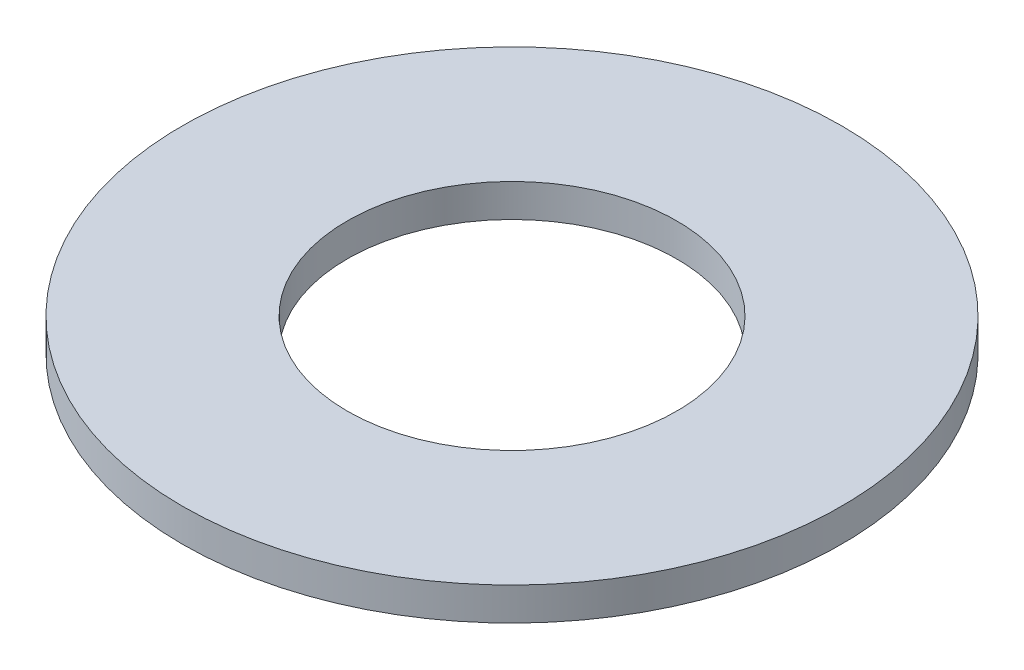
ISO-10303-21;
HEADER;
FILE_DESCRIPTION(('STEP AP214'),'2;1');
FILE_NAME('part.step','',(''),(''),'','','');
FILE_SCHEMA(('AUTOMOTIVE_DESIGN { 1 0 10303 214 1 1 1 1 }'));
ENDSEC;
DATA;
#1=APPLICATION_CONTEXT('core data for automotive mechanical design processes');
#2=APPLICATION_PROTOCOL_DEFINITION('international standard','automotive_design',2000,#1);
#3=PRODUCT_CONTEXT('',#1,'mechanical');
#4=PRODUCT('Part','Part','',(#3));
#5=PRODUCT_RELATED_PRODUCT_CATEGORY('part','',(#4));
#6=PRODUCT_DEFINITION_FORMATION('','',#4);
#7=PRODUCT_DEFINITION_CONTEXT('part definition',#1,'design');
#8=PRODUCT_DEFINITION('design','',#6,#7);
#9=PRODUCT_DEFINITION_SHAPE('','',#8);
#10=(LENGTH_UNIT() NAMED_UNIT(*) SI_UNIT(.MILLI.,.METRE.));
#11=(NAMED_UNIT(*) PLANE_ANGLE_UNIT() SI_UNIT($,.RADIAN.));
#12=(NAMED_UNIT(*) SI_UNIT($,.STERADIAN.) SOLID_ANGLE_UNIT());
#13=UNCERTAINTY_MEASURE_WITH_UNIT(LENGTH_MEASURE(1.E-05),#10,'distance_accuracy_value','');
#14=(GEOMETRIC_REPRESENTATION_CONTEXT(3) GLOBAL_UNCERTAINTY_ASSIGNED_CONTEXT((#13)) GLOBAL_UNIT_ASSIGNED_CONTEXT((#10,
#11,#12)) REPRESENTATION_CONTEXT('',''));
#15=CARTESIAN_POINT('',(0.,0.,0.));
#16=DIRECTION('',(0.,0.,1.));
#17=DIRECTION('',(1.,0.,0.));
#18=AXIS2_PLACEMENT_3D('',#15,#16,#17);
#19=CARTESIAN_POINT('',(0.,9.,0.));
#20=DIRECTION('',(0.,-1.,0.));
#21=DIRECTION('',(0.,0.,-1.));
#22=AXIS2_PLACEMENT_3D('',#19,#20,#21);
#23=CYLINDRICAL_SURFACE('',#22,90.);
#24=CARTESIAN_POINT('',(0.,9.,0.));
#25=DIRECTION('',(0.,1.,0.));
#26=DIRECTION('',(0.,0.,1.));
#27=AXIS2_PLACEMENT_3D('',#24,#25,#26);
#28=CIRCLE('',#27,90.);
#29=CARTESIAN_POINT('',(0.,9.,90.));
#30=VERTEX_POINT('',#29);
#31=EDGE_CURVE('E10',#30,#30,#28,.T.);
#32=ORIENTED_EDGE('',*,*,#31,.F.);
#33=EDGE_LOOP('',(#32));
#34=FACE_BOUND('',#33,.T.);
#35=CARTESIAN_POINT('',(0.,0.,0.));
#36=DIRECTION('',(0.,1.,0.));
#37=DIRECTION('',(0.,0.,1.));
#38=AXIS2_PLACEMENT_3D('',#35,#36,#37);
#39=CIRCLE('',#38,90.);
#40=CARTESIAN_POINT('',(0.,0.,90.));
#41=VERTEX_POINT('',#40);
#42=EDGE_CURVE('E37',#41,#41,#39,.T.);
#43=ORIENTED_EDGE('',*,*,#42,.T.);
#44=EDGE_LOOP('',(#43));
#45=FACE_BOUND('',#44,.T.);
#46=ADVANCED_FACE('F40',(#34,#45),#23,.T.);
#47=CARTESIAN_POINT('',(0.,9.,0.));
#48=DIRECTION('',(0.,1.,0.));
#49=DIRECTION('',(0.,0.,1.));
#50=AXIS2_PLACEMENT_3D('',#47,#48,#49);
#51=PLANE('',#50);
#52=CARTESIAN_POINT('',(0.,9.,0.));
#53=DIRECTION('',(0.,1.,0.));
#54=DIRECTION('',(0.,0.,1.));
#55=AXIS2_PLACEMENT_3D('',#52,#53,#54);
#56=CIRCLE('',#55,45.);
#57=CARTESIAN_POINT('',(0.,9.,45.));
#58=VERTEX_POINT('',#57);
#59=EDGE_CURVE('E50',#58,#58,#56,.T.);
#60=ORIENTED_EDGE('',*,*,#59,.F.);
#61=EDGE_LOOP('',(#60));
#62=FACE_BOUND('',#61,.T.);
#63=ORIENTED_EDGE('',*,*,#31,.T.);
#64=EDGE_LOOP('',(#63));
#65=FACE_BOUND('',#64,.T.);
#66=ADVANCED_FACE('F59',(#62,#65),#51,.T.);
#67=CARTESIAN_POINT('',(0.,0.,0.));
#68=DIRECTION('',(0.,1.,0.));
#69=DIRECTION('',(0.,0.,1.));
#70=AXIS2_PLACEMENT_3D('',#67,#68,#69);
#71=PLANE('',#70);
#72=CARTESIAN_POINT('',(0.,0.,0.));
#73=DIRECTION('',(0.,1.,0.));
#74=DIRECTION('',(0.,0.,1.));
#75=AXIS2_PLACEMENT_3D('',#72,#73,#74);
#76=CIRCLE('',#75,45.);
#77=CARTESIAN_POINT('',(0.,0.,45.));
#78=VERTEX_POINT('',#77);
#79=EDGE_CURVE('E47',#78,#78,#76,.T.);
#80=ORIENTED_EDGE('',*,*,#79,.T.);
#81=EDGE_LOOP('',(#80));
#82=FACE_BOUND('',#81,.T.);
#83=ORIENTED_EDGE('',*,*,#42,.F.);
#84=EDGE_LOOP('',(#83));
#85=FACE_BOUND('',#84,.T.);
#86=ADVANCED_FACE('F58',(#82,#85),#71,.F.);
#87=CARTESIAN_POINT('',(0.,9.,0.));
#88=DIRECTION('',(0.,-1.,0.));
#89=DIRECTION('',(0.,0.,-1.));
#90=AXIS2_PLACEMENT_3D('',#87,#88,#89);
#91=CYLINDRICAL_SURFACE('',#90,45.);
#92=ORIENTED_EDGE('',*,*,#59,.T.);
#93=EDGE_LOOP('',(#92));
#94=FACE_BOUND('',#93,.T.);
#95=ORIENTED_EDGE('',*,*,#79,.F.);
#96=EDGE_LOOP('',(#95));
#97=FACE_BOUND('',#96,.T.);
#98=ADVANCED_FACE('F54',(#94,#97),#91,.F.);
#99=CLOSED_SHELL('',(#46,#66,#86,#98));
#100=MANIFOLD_SOLID_BREP('B2',#99);
#101=ADVANCED_BREP_SHAPE_REPRESENTATION('',(#18,#100),#14);
#102=SHAPE_DEFINITION_REPRESENTATION(#9,#101);
ENDSEC;
END-ISO-10303-21;
